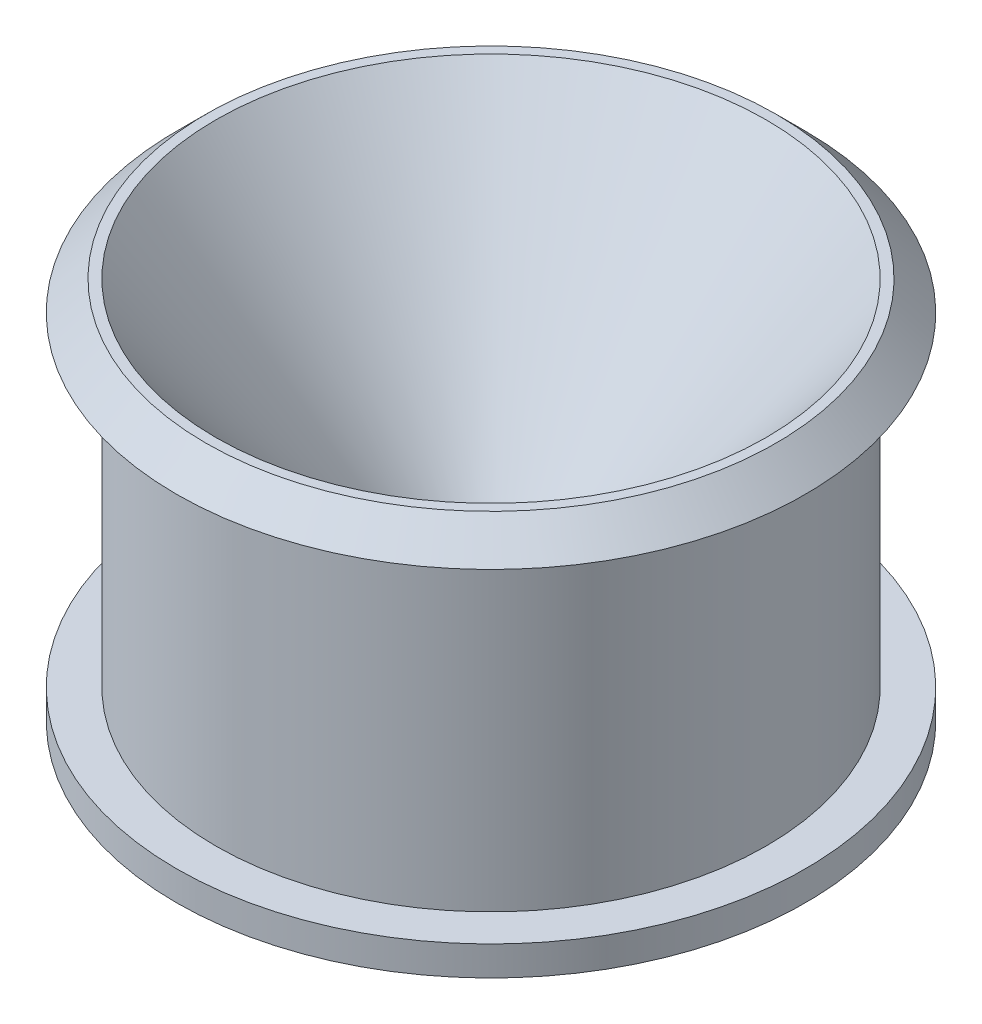
ISO-10303-21;
HEADER;
FILE_DESCRIPTION(('STEP AP214'),'2;1');
FILE_NAME('part.step','',(''),(''),'','','');
FILE_SCHEMA(('AUTOMOTIVE_DESIGN { 1 0 10303 214 1 1 1 1 }'));
ENDSEC;
DATA;
#1=APPLICATION_CONTEXT('core data for automotive mechanical design processes');
#2=APPLICATION_PROTOCOL_DEFINITION('international standard','automotive_design',2000,#1);
#3=PRODUCT_CONTEXT('',#1,'mechanical');
#4=PRODUCT('Part','Part','',(#3));
#5=PRODUCT_RELATED_PRODUCT_CATEGORY('part','',(#4));
#6=PRODUCT_DEFINITION_FORMATION('','',#4);
#7=PRODUCT_DEFINITION_CONTEXT('part definition',#1,'design');
#8=PRODUCT_DEFINITION('design','',#6,#7);
#9=PRODUCT_DEFINITION_SHAPE('','',#8);
#10=(LENGTH_UNIT() NAMED_UNIT(*) SI_UNIT(.MILLI.,.METRE.));
#11=(NAMED_UNIT(*) PLANE_ANGLE_UNIT() SI_UNIT($,.RADIAN.));
#12=(NAMED_UNIT(*) SI_UNIT($,.STERADIAN.) SOLID_ANGLE_UNIT());
#13=UNCERTAINTY_MEASURE_WITH_UNIT(LENGTH_MEASURE(1.E-05),#10,'distance_accuracy_value','');
#14=(GEOMETRIC_REPRESENTATION_CONTEXT(3) GLOBAL_UNCERTAINTY_ASSIGNED_CONTEXT((#13)) GLOBAL_UNIT_ASSIGNED_CONTEXT((#10,
#11,#12)) REPRESENTATION_CONTEXT('',''));
#15=CARTESIAN_POINT('',(0.,0.,0.));
#16=DIRECTION('',(0.,0.,1.));
#17=DIRECTION('',(1.,0.,0.));
#18=AXIS2_PLACEMENT_3D('',#15,#16,#17);
#19=CARTESIAN_POINT('',(0.,8.,0.));
#20=DIRECTION('',(0.,1.,0.));
#21=DIRECTION('',(0.,0.,1.));
#22=AXIS2_PLACEMENT_3D('',#19,#20,#21);
#23=PLANE('',#22);
#24=CARTESIAN_POINT('',(0.,8.,0.));
#25=DIRECTION('',(0.,-1.,0.));
#26=DIRECTION('',(0.,0.,-1.));
#27=AXIS2_PLACEMENT_3D('',#24,#25,#26);
#28=CIRCLE('',#27,3.);
#29=CARTESIAN_POINT('',(0.,8.,-3.));
#30=VERTEX_POINT('',#29);
#31=EDGE_CURVE('E74',#30,#30,#28,.T.);
#32=ORIENTED_EDGE('',*,*,#31,.T.);
#33=EDGE_LOOP('',(#32));
#34=FACE_BOUND('',#33,.T.);
#35=CARTESIAN_POINT('',(0.,8.,0.));
#36=DIRECTION('',(0.,-1.,0.));
#37=DIRECTION('',(0.,0.,-1.));
#38=AXIS2_PLACEMENT_3D('',#35,#36,#37);
#39=CIRCLE('',#38,7.);
#40=CARTESIAN_POINT('',(0.,8.,-7.));
#41=VERTEX_POINT('',#40);
#42=EDGE_CURVE('E43',#41,#41,#39,.T.);
#43=ORIENTED_EDGE('',*,*,#42,.F.);
#44=EDGE_LOOP('',(#43));
#45=FACE_BOUND('',#44,.T.);
#46=ADVANCED_FACE('F36',(#34,#45),#23,.T.);
#47=CARTESIAN_POINT('',(0.,0.,0.));
#48=DIRECTION('',(0.,-1.,0.));
#49=DIRECTION('',(0.,0.,-1.));
#50=AXIS2_PLACEMENT_3D('',#47,#48,#49);
#51=CYLINDRICAL_SURFACE('',#50,7.);
#52=ORIENTED_EDGE('',*,*,#42,.T.);
#53=EDGE_LOOP('',(#52));
#54=FACE_BOUND('',#53,.T.);
#55=CARTESIAN_POINT('',(0.,12.96,0.));
#56=DIRECTION('',(0.,-1.,0.));
#57=DIRECTION('',(0.,0.,-1.));
#58=AXIS2_PLACEMENT_3D('',#55,#56,#57);
#59=CIRCLE('',#58,7.);
#60=CARTESIAN_POINT('',(0.,12.96,7.));
#61=VERTEX_POINT('',#60);
#62=EDGE_CURVE('E47',#61,#61,#59,.T.);
#63=ORIENTED_EDGE('',*,*,#62,.F.);
#64=EDGE_LOOP('',(#63));
#65=FACE_BOUND('',#64,.T.);
#66=ADVANCED_FACE('F104',(#54,#65),#51,.F.);
#67=CARTESIAN_POINT('',(0.,12.96,0.));
#68=DIRECTION('',(0.,1.,0.));
#69=DIRECTION('',(0.,0.,1.));
#70=AXIS2_PLACEMENT_3D('',#67,#68,#69);
#71=CONICAL_SURFACE('',#70,7.,0.678662490748313);
#72=CARTESIAN_POINT('',(0.,39.,0.));
#73=DIRECTION('',(0.,-1.,0.));
#74=DIRECTION('',(0.,0.,-1.));
#75=AXIS2_PLACEMENT_3D('',#72,#73,#74);
#76=CIRCLE('',#75,28.);
#77=CARTESIAN_POINT('',(0.,39.,28.));
#78=VERTEX_POINT('',#77);
#79=EDGE_CURVE('E51',#78,#78,#76,.T.);
#80=CARTESIAN_POINT('',(0.,39.,28.));
#81=CARTESIAN_POINT('',(0.,38.72875,27.78125));
#82=CARTESIAN_POINT('',(0.,38.4575,27.5625));
#83=CARTESIAN_POINT('',(0.,37.915,27.125));
#84=CARTESIAN_POINT('',(0.,37.64375,26.90625));
#85=CARTESIAN_POINT('',(0.,37.10125,26.46875));
#86=CARTESIAN_POINT('',(0.,36.83,26.25));
#87=CARTESIAN_POINT('',(0.,36.2875,25.8125));
#88=CARTESIAN_POINT('',(0.,36.01625,25.59375));
#89=CARTESIAN_POINT('',(0.,35.47375,25.15625));
#90=CARTESIAN_POINT('',(0.,35.2025,24.9375));
#91=CARTESIAN_POINT('',(0.,34.66,24.5));
#92=CARTESIAN_POINT('',(0.,34.38875,24.28125));
#93=CARTESIAN_POINT('',(0.,33.84625,23.84375));
#94=CARTESIAN_POINT('',(0.,33.575,23.625));
#95=CARTESIAN_POINT('',(0.,33.0325,23.1875));
#96=CARTESIAN_POINT('',(0.,32.76125,22.96875));
#97=CARTESIAN_POINT('',(0.,32.21875,22.53125));
#98=CARTESIAN_POINT('',(0.,31.9475,22.3125));
#99=CARTESIAN_POINT('',(0.,31.405,21.875));
#100=CARTESIAN_POINT('',(0.,31.13375,21.65625));
#101=CARTESIAN_POINT('',(0.,30.59125,21.21875));
#102=CARTESIAN_POINT('',(0.,30.32,21.));
#103=CARTESIAN_POINT('',(0.,29.7775,20.5625));
#104=CARTESIAN_POINT('',(0.,29.50625,20.34375));
#105=CARTESIAN_POINT('',(0.,28.96375,19.90625));
#106=CARTESIAN_POINT('',(0.,28.6925,19.6875));
#107=CARTESIAN_POINT('',(0.,28.15,19.25));
#108=CARTESIAN_POINT('',(0.,27.87875,19.03125));
#109=CARTESIAN_POINT('',(0.,27.33625,18.59375));
#110=CARTESIAN_POINT('',(0.,27.065,18.375));
#111=CARTESIAN_POINT('',(0.,26.5225,17.9375));
#112=CARTESIAN_POINT('',(0.,26.25125,17.71875));
#113=CARTESIAN_POINT('',(0.,25.70875,17.28125));
#114=CARTESIAN_POINT('',(0.,25.4375,17.0625));
#115=CARTESIAN_POINT('',(0.,24.895,16.625));
#116=CARTESIAN_POINT('',(0.,24.62375,16.40625));
#117=CARTESIAN_POINT('',(0.,24.08125,15.96875));
#118=CARTESIAN_POINT('',(0.,23.81,15.75));
#119=CARTESIAN_POINT('',(0.,23.2675,15.3125));
#120=CARTESIAN_POINT('',(0.,22.99625,15.09375));
#121=CARTESIAN_POINT('',(0.,22.45375,14.65625));
#122=CARTESIAN_POINT('',(0.,22.1825,14.4375));
#123=CARTESIAN_POINT('',(0.,21.64,14.));
#124=CARTESIAN_POINT('',(0.,21.36875,13.78125));
#125=CARTESIAN_POINT('',(0.,20.82625,13.34375));
#126=CARTESIAN_POINT('',(0.,20.555,13.125));
#127=CARTESIAN_POINT('',(0.,20.0125,12.6875));
#128=CARTESIAN_POINT('',(0.,19.74125,12.46875));
#129=CARTESIAN_POINT('',(0.,19.19875,12.03125));
#130=CARTESIAN_POINT('',(0.,18.9275,11.8125));
#131=CARTESIAN_POINT('',(0.,18.385,11.375));
#132=CARTESIAN_POINT('',(0.,18.11375,11.15625));
#133=CARTESIAN_POINT('',(0.,17.57125,10.71875));
#134=CARTESIAN_POINT('',(0.,17.3,10.5));
#135=CARTESIAN_POINT('',(0.,16.7575,10.0625));
#136=CARTESIAN_POINT('',(0.,16.48625,9.84375));
#137=CARTESIAN_POINT('',(0.,15.94375,9.40625));
#138=CARTESIAN_POINT('',(0.,15.6725,9.1875));
#139=CARTESIAN_POINT('',(0.,15.13,8.75));
#140=CARTESIAN_POINT('',(0.,14.85875,8.53125));
#141=CARTESIAN_POINT('',(0.,14.31625,8.09375));
#142=CARTESIAN_POINT('',(0.,14.045,7.875));
#143=CARTESIAN_POINT('',(0.,13.5025,7.4375));
#144=CARTESIAN_POINT('',(0.,13.23125,7.21875));
#145=CARTESIAN_POINT('',(0.,12.96,7.));
#146=B_SPLINE_CURVE_WITH_KNOTS('',3,(#80,#81,#82,#83,#84,#85,#86,#87,#88,#89,#90,#91,#92,#93,
#94,#95,#96,#97,#98,#99,#100,#101,#102,#103,#104,#105,#106,#107,#108,#109,#110,#111,#112,#113,
#114,#115,#116,#117,#118,#119,#120,#121,#122,#123,#124,#125,#126,#127,#128,#129,#130,#131,#132,
#133,#134,#135,#136,#137,#138,#139,#140,#141,#142,#143,#144,#145),.UNSPECIFIED.,.F.,.F.,(4,2,2,
2,2,2,2,2,2,2,2,2,2,2,2,2,2,2,2,2,2,2,2,2,2,2,2,2,2,2,2,2,4),(0.,1.04539615696634,
2.09079231393269,3.13618847089903,4.18158462786538,5.22698078483172,6.27237694179806,
7.3177730987644,8.36316925573075,9.40856541269709,10.4539615696634,11.4993577266298,
12.5447538835961,13.5901500405625,14.6355461975288,15.6809423544952,16.7263385114615,
17.7717346684278,18.8171308253942,19.8625269823605,20.9079231393269,21.9533192962932,
22.9987154532596,24.0441116102259,25.0895077671922,26.1349039241586,27.1803000811249,
28.2256962380913,29.2710923950576,30.316488552024,31.3618847089903,32.4072808659567,
33.452677022923),.UNSPECIFIED.);
#147=EDGE_CURVE('BSEAM108',#78,#61,#146,.T.);
#148=ORIENTED_EDGE('',*,*,#79,.F.);
#149=ORIENTED_EDGE('',*,*,#62,.T.);
#150=ORIENTED_EDGE('',*,*,#147,.T.);
#151=ORIENTED_EDGE('',*,*,#147,.F.);
#152=EDGE_LOOP('',(#148,#150,#149,#151));
#153=FACE_BOUND('',#152,.T.);
#154=ADVANCED_FACE('F108',(#153),#71,.F.);
#155=CARTESIAN_POINT('',(0.,39.,0.));
#156=DIRECTION('',(0.,-1.,0.));
#157=DIRECTION('',(0.,0.,-1.));
#158=AXIS2_PLACEMENT_3D('',#155,#156,#157);
#159=PLANE('',#158);
#160=CARTESIAN_POINT('',(0.,39.,0.));
#161=DIRECTION('',(0.,-1.,0.));
#162=DIRECTION('',(0.,0.,-1.));
#163=AXIS2_PLACEMENT_3D('',#160,#161,#162);
#164=CIRCLE('',#163,29.);
#165=CARTESIAN_POINT('',(0.,39.,-29.));
#166=VERTEX_POINT('',#165);
#167=EDGE_CURVE('E10',#166,#166,#164,.F.);
#168=ORIENTED_EDGE('',*,*,#167,.T.);
#169=EDGE_LOOP('',(#168));
#170=FACE_BOUND('',#169,.T.);
#171=ORIENTED_EDGE('',*,*,#79,.T.);
#172=EDGE_LOOP('',(#171));
#173=FACE_BOUND('',#172,.T.);
#174=ADVANCED_FACE('F113',(#170,#173),#159,.F.);
#175=CARTESIAN_POINT('',(0.,36.,0.));
#176=DIRECTION('',(0.,-1.,0.));
#177=DIRECTION('',(0.,0.,-1.));
#178=AXIS2_PLACEMENT_3D('',#175,#176,#177);
#179=PLANE('',#178);
#180=CARTESIAN_POINT('',(0.,36.,0.));
#181=DIRECTION('',(0.,-1.,0.));
#182=DIRECTION('',(0.,0.,-1.));
#183=AXIS2_PLACEMENT_3D('',#180,#181,#182);
#184=CIRCLE('',#183,32.);
#185=CARTESIAN_POINT('',(0.,36.,-32.));
#186=VERTEX_POINT('',#185);
#187=EDGE_CURVE('E56',#186,#186,#184,.T.);
#188=ORIENTED_EDGE('',*,*,#187,.T.);
#189=EDGE_LOOP('',(#188));
#190=FACE_BOUND('',#189,.T.);
#191=CARTESIAN_POINT('',(0.,36.,0.));
#192=DIRECTION('',(0.,-1.,0.));
#193=DIRECTION('',(0.,0.,-1.));
#194=AXIS2_PLACEMENT_3D('',#191,#192,#193);
#195=CIRCLE('',#194,28.);
#196=CARTESIAN_POINT('',(0.,36.,-28.));
#197=VERTEX_POINT('',#196);
#198=EDGE_CURVE('E59',#197,#197,#195,.T.);
#199=ORIENTED_EDGE('',*,*,#198,.F.);
#200=EDGE_LOOP('',(#199));
#201=FACE_BOUND('',#200,.T.);
#202=ADVANCED_FACE('F117',(#190,#201),#179,.T.);
#203=CARTESIAN_POINT('',(0.,0.,0.));
#204=DIRECTION('',(0.,-1.,0.));
#205=DIRECTION('',(0.,0.,-1.));
#206=AXIS2_PLACEMENT_3D('',#203,#204,#205);
#207=CYLINDRICAL_SURFACE('',#206,28.);
#208=CARTESIAN_POINT('',(0.,3.,0.));
#209=DIRECTION('',(0.,-1.,0.));
#210=DIRECTION('',(0.,0.,-1.));
#211=AXIS2_PLACEMENT_3D('',#208,#209,#210);
#212=CIRCLE('',#211,28.);
#213=CARTESIAN_POINT('',(0.,3.,-28.));
#214=VERTEX_POINT('',#213);
#215=EDGE_CURVE('E62',#214,#214,#212,.T.);
#216=ORIENTED_EDGE('',*,*,#215,.F.);
#217=EDGE_LOOP('',(#216));
#218=FACE_BOUND('',#217,.T.);
#219=ORIENTED_EDGE('',*,*,#198,.T.);
#220=EDGE_LOOP('',(#219));
#221=FACE_BOUND('',#220,.T.);
#222=ADVANCED_FACE('F100',(#218,#221),#207,.T.);
#223=CARTESIAN_POINT('',(0.,3.,0.));
#224=DIRECTION('',(0.,-1.,0.));
#225=DIRECTION('',(0.,0.,-1.));
#226=AXIS2_PLACEMENT_3D('',#223,#224,#225);
#227=PLANE('',#226);
#228=CARTESIAN_POINT('',(0.,3.,0.));
#229=DIRECTION('',(0.,-1.,0.));
#230=DIRECTION('',(0.,0.,-1.));
#231=AXIS2_PLACEMENT_3D('',#228,#229,#230);
#232=CIRCLE('',#231,32.);
#233=CARTESIAN_POINT('',(0.,3.,-32.));
#234=VERTEX_POINT('',#233);
#235=EDGE_CURVE('E65',#234,#234,#232,.T.);
#236=ORIENTED_EDGE('',*,*,#235,.F.);
#237=EDGE_LOOP('',(#236));
#238=FACE_BOUND('',#237,.T.);
#239=ORIENTED_EDGE('',*,*,#215,.T.);
#240=EDGE_LOOP('',(#239));
#241=FACE_BOUND('',#240,.T.);
#242=ADVANCED_FACE('F94',(#238,#241),#227,.F.);
#243=CARTESIAN_POINT('',(0.,0.,0.));
#244=DIRECTION('',(0.,-1.,0.));
#245=DIRECTION('',(0.,0.,-1.));
#246=AXIS2_PLACEMENT_3D('',#243,#244,#245);
#247=CYLINDRICAL_SURFACE('',#246,32.);
#248=ORIENTED_EDGE('',*,*,#235,.T.);
#249=EDGE_LOOP('',(#248));
#250=FACE_BOUND('',#249,.T.);
#251=CARTESIAN_POINT('',(0.,0.,0.));
#252=DIRECTION('',(0.,-1.,0.));
#253=DIRECTION('',(0.,0.,-1.));
#254=AXIS2_PLACEMENT_3D('',#251,#252,#253);
#255=CIRCLE('',#254,32.);
#256=CARTESIAN_POINT('',(0.,0.,-32.));
#257=VERTEX_POINT('',#256);
#258=EDGE_CURVE('E68',#257,#257,#255,.T.);
#259=ORIENTED_EDGE('',*,*,#258,.F.);
#260=EDGE_LOOP('',(#259));
#261=FACE_BOUND('',#260,.T.);
#262=ADVANCED_FACE('F89',(#250,#261),#247,.T.);
#263=CARTESIAN_POINT('',(0.,0.,0.));
#264=DIRECTION('',(0.,1.,0.));
#265=DIRECTION('',(0.,0.,1.));
#266=AXIS2_PLACEMENT_3D('',#263,#264,#265);
#267=PLANE('',#266);
#268=CARTESIAN_POINT('',(0.,0.,0.));
#269=DIRECTION('',(0.,-1.,0.));
#270=DIRECTION('',(0.,0.,-1.));
#271=AXIS2_PLACEMENT_3D('',#268,#269,#270);
#272=CIRCLE('',#271,3.);
#273=CARTESIAN_POINT('',(0.,0.,-3.));
#274=VERTEX_POINT('',#273);
#275=EDGE_CURVE('E71',#274,#274,#272,.T.);
#276=ORIENTED_EDGE('',*,*,#275,.F.);
#277=EDGE_LOOP('',(#276));
#278=FACE_BOUND('',#277,.T.);
#279=ORIENTED_EDGE('',*,*,#258,.T.);
#280=EDGE_LOOP('',(#279));
#281=FACE_BOUND('',#280,.T.);
#282=ADVANCED_FACE('F83',(#278,#281),#267,.F.);
#283=CARTESIAN_POINT('',(0.,0.,0.));
#284=DIRECTION('',(0.,-1.,0.));
#285=DIRECTION('',(0.,0.,-1.));
#286=AXIS2_PLACEMENT_3D('',#283,#284,#285);
#287=CYLINDRICAL_SURFACE('',#286,3.);
#288=ORIENTED_EDGE('',*,*,#31,.F.);
#289=EDGE_LOOP('',(#288));
#290=FACE_BOUND('',#289,.T.);
#291=ORIENTED_EDGE('',*,*,#275,.T.);
#292=EDGE_LOOP('',(#291));
#293=FACE_BOUND('',#292,.T.);
#294=ADVANCED_FACE('F80',(#290,#293),#287,.F.);
#295=CARTESIAN_POINT('',(0.,36.,0.));
#296=DIRECTION('',(0.,-1.,0.));
#297=DIRECTION('',(0.,0.,-1.));
#298=AXIS2_PLACEMENT_3D('',#295,#296,#297);
#299=CONICAL_SURFACE('',#298,32.,0.78539816339745);
#300=ORIENTED_EDGE('',*,*,#167,.F.);
#301=EDGE_LOOP('',(#300));
#302=FACE_BOUND('',#301,.T.);
#303=ORIENTED_EDGE('',*,*,#187,.F.);
#304=EDGE_LOOP('',(#303));
#305=FACE_BOUND('',#304,.T.);
#306=ADVANCED_FACE('F38',(#302,#305),#299,.T.);
#307=CLOSED_SHELL('',(#46,#66,#154,#174,#202,#222,#242,#262,#282,#294,#306));
#308=MANIFOLD_SOLID_BREP('B2',#307);
#309=ADVANCED_BREP_SHAPE_REPRESENTATION('',(#18,#308),#14);
#310=SHAPE_DEFINITION_REPRESENTATION(#9,#309);
ENDSEC;
END-ISO-10303-21;
